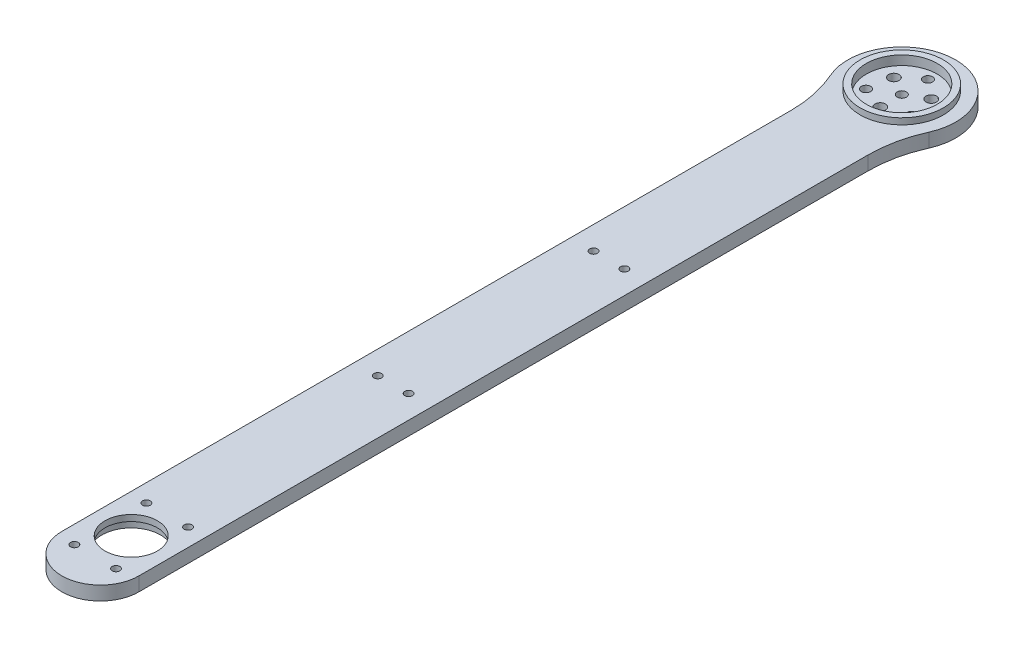
ISO-10303-21;
HEADER;
FILE_DESCRIPTION(('STEP AP214'),'2;1');
FILE_NAME('part.step','',(''),(''),'','','');
FILE_SCHEMA(('AUTOMOTIVE_DESIGN { 1 0 10303 214 1 1 1 1 }'));
ENDSEC;
DATA;
#1=APPLICATION_CONTEXT('core data for automotive mechanical design processes');
#2=APPLICATION_PROTOCOL_DEFINITION('international standard','automotive_design',2000,#1);
#3=PRODUCT_CONTEXT('',#1,'mechanical');
#4=PRODUCT('Part','Part','',(#3));
#5=PRODUCT_RELATED_PRODUCT_CATEGORY('part','',(#4));
#6=PRODUCT_DEFINITION_FORMATION('','',#4);
#7=PRODUCT_DEFINITION_CONTEXT('part definition',#1,'design');
#8=PRODUCT_DEFINITION('design','',#6,#7);
#9=PRODUCT_DEFINITION_SHAPE('','',#8);
#10=(LENGTH_UNIT() NAMED_UNIT(*) SI_UNIT(.MILLI.,.METRE.));
#11=(NAMED_UNIT(*) PLANE_ANGLE_UNIT() SI_UNIT($,.RADIAN.));
#12=(NAMED_UNIT(*) SI_UNIT($,.STERADIAN.) SOLID_ANGLE_UNIT());
#13=UNCERTAINTY_MEASURE_WITH_UNIT(LENGTH_MEASURE(1.E-05),#10,'distance_accuracy_value','');
#14=(GEOMETRIC_REPRESENTATION_CONTEXT(3) GLOBAL_UNCERTAINTY_ASSIGNED_CONTEXT((#13)) GLOBAL_UNIT_ASSIGNED_CONTEXT((#10,
#11,#12)) REPRESENTATION_CONTEXT('',''));
#15=CARTESIAN_POINT('',(0.,0.,0.));
#16=DIRECTION('',(0.,0.,1.));
#17=DIRECTION('',(1.,0.,0.));
#18=AXIS2_PLACEMENT_3D('',#15,#16,#17);
#19=CARTESIAN_POINT('',(-32.4505054253004,4.5,-1111.));
#20=DIRECTION('',(0.,1.,0.));
#21=DIRECTION('',(0.,0.,1.));
#22=AXIS2_PLACEMENT_3D('',#19,#20,#21);
#23=PLANE('',#22);
#24=CARTESIAN_POINT('',(-7.36121593216777,4.5,4.24999999999993));
#25=DIRECTION('',(0.,1.,0.));
#26=DIRECTION('',(0.,0.,1.));
#27=AXIS2_PLACEMENT_3D('',#24,#25,#26);
#28=CIRCLE('',#27,1.49999999999999);
#29=CARTESIAN_POINT('',(-7.36121593216777,4.5,5.74999999999992));
#30=VERTEX_POINT('',#29);
#31=EDGE_CURVE('E47',#30,#30,#28,.T.);
#32=ORIENTED_EDGE('',*,*,#31,.T.);
#33=EDGE_LOOP('',(#32));
#34=FACE_BOUND('',#33,.T.);
#35=CARTESIAN_POINT('',(7.36121593216771,4.5,4.25000000000003));
#36=DIRECTION('',(0.,1.,0.));
#37=DIRECTION('',(0.,0.,1.));
#38=AXIS2_PLACEMENT_3D('',#35,#36,#37);
#39=CIRCLE('',#38,1.49999999999999);
#40=CARTESIAN_POINT('',(7.36121593216771,4.5,5.75000000000002));
#41=VERTEX_POINT('',#40);
#42=EDGE_CURVE('E177',#41,#41,#39,.T.);
#43=ORIENTED_EDGE('',*,*,#42,.T.);
#44=EDGE_LOOP('',(#43));
#45=FACE_BOUND('',#44,.T.);
#46=CARTESIAN_POINT('',(0.,4.5,-8.5));
#47=DIRECTION('',(0.,1.,0.));
#48=DIRECTION('',(0.,0.,1.));
#49=AXIS2_PLACEMENT_3D('',#46,#47,#48);
#50=CIRCLE('',#49,1.49999999999999);
#51=CARTESIAN_POINT('',(0.,4.5,-7.00000000000001));
#52=VERTEX_POINT('',#51);
#53=EDGE_CURVE('E172',#52,#52,#50,.T.);
#54=ORIENTED_EDGE('',*,*,#53,.T.);
#55=EDGE_LOOP('',(#54));
#56=FACE_BOUND('',#55,.T.);
#57=CARTESIAN_POINT('',(0.,4.5,0.));
#58=DIRECTION('',(0.,-1.,0.));
#59=DIRECTION('',(0.,0.,-1.));
#60=AXIS2_PLACEMENT_3D('',#57,#58,#59);
#61=CIRCLE('',#60,1.49999999999999);
#62=CARTESIAN_POINT('',(0.,4.5,-1.49999999999999));
#63=VERTEX_POINT('',#62);
#64=EDGE_CURVE('E175',#63,#63,#61,.T.);
#65=ORIENTED_EDGE('',*,*,#64,.F.);
#66=EDGE_LOOP('',(#65));
#67=FACE_BOUND('',#66,.T.);
#68=CARTESIAN_POINT('',(-6.74999999999998,4.5,238.30865704891));
#69=DIRECTION('',(0.,-1.,0.));
#70=DIRECTION('',(0.,0.,-1.));
#71=AXIS2_PLACEMENT_3D('',#68,#69,#70);
#72=CIRCLE('',#71,1.25);
#73=CARTESIAN_POINT('',(-6.74999999999998,4.5,237.05865704891));
#74=VERTEX_POINT('',#73);
#75=EDGE_CURVE('E203',#74,#74,#72,.T.);
#76=ORIENTED_EDGE('',*,*,#75,.F.);
#77=EDGE_LOOP('',(#76));
#78=FACE_BOUND('',#77,.T.);
#79=CARTESIAN_POINT('',(-6.75,4.5,261.69134295109));
#80=DIRECTION('',(0.,-1.,0.));
#81=DIRECTION('',(0.,0.,-1.));
#82=AXIS2_PLACEMENT_3D('',#79,#80,#81);
#83=CIRCLE('',#82,1.25);
#84=CARTESIAN_POINT('',(-6.75,4.5,260.44134295109));
#85=VERTEX_POINT('',#84);
#86=EDGE_CURVE('E221',#85,#85,#83,.T.);
#87=ORIENTED_EDGE('',*,*,#86,.F.);
#88=EDGE_LOOP('',(#87));
#89=FACE_BOUND('',#88,.T.);
#90=CARTESIAN_POINT('',(-4.99999999999998,4.5,95.));
#91=DIRECTION('',(0.,-1.,0.));
#92=DIRECTION('',(0.,0.,-1.));
#93=AXIS2_PLACEMENT_3D('',#90,#91,#92);
#94=CIRCLE('',#93,1.24999999999999);
#95=CARTESIAN_POINT('',(-4.99999999999998,4.5,93.75));
#96=VERTEX_POINT('',#95);
#97=EDGE_CURVE('E233',#96,#96,#94,.T.);
#98=ORIENTED_EDGE('',*,*,#97,.F.);
#99=EDGE_LOOP('',(#98));
#100=FACE_BOUND('',#99,.T.);
#101=CARTESIAN_POINT('',(-6.06217782649106,4.5,-3.50000000000003));
#102=DIRECTION('',(0.,1.,0.));
#103=DIRECTION('',(0.,0.,1.));
#104=AXIS2_PLACEMENT_3D('',#101,#102,#103);
#105=CIRCLE('',#104,1.7);
#106=CARTESIAN_POINT('',(-6.06217782649106,4.5,-1.80000000000003));
#107=VERTEX_POINT('',#106);
#108=EDGE_CURVE('E265',#107,#107,#105,.F.);
#109=ORIENTED_EDGE('',*,*,#108,.F.);
#110=EDGE_LOOP('',(#109));
#111=FACE_BOUND('',#110,.T.);
#112=CARTESIAN_POINT('',(0.,4.5,250.));
#113=DIRECTION('',(0.,1.,0.));
#114=DIRECTION('',(0.,0.,1.));
#115=AXIS2_PLACEMENT_3D('',#112,#113,#114);
#116=CIRCLE('',#115,9.50000000000001);
#117=CARTESIAN_POINT('',(0.,4.5,259.5));
#118=VERTEX_POINT('',#117);
#119=EDGE_CURVE('E257',#118,#118,#116,.F.);
#120=ORIENTED_EDGE('',*,*,#119,.F.);
#121=EDGE_LOOP('',(#120));
#122=FACE_BOUND('',#121,.T.);
#123=DIRECTION('',(0.,0.,1.));
#124=VECTOR('',#123,1.);
#125=CARTESIAN_POINT('',(-12.5,4.5,260.));
#126=LINE('',#125,#124);
#127=CARTESIAN_POINT('',(-12.5,4.5,23.4520787991171));
#128=VERTEX_POINT('',#127);
#129=CARTESIAN_POINT('',(-12.5,4.5,260.));
#130=VERTEX_POINT('',#129);
#131=EDGE_CURVE('E61',#128,#130,#126,.T.);
#132=ORIENTED_EDGE('',*,*,#131,.F.);
#133=CARTESIAN_POINT('',(-52.5,4.5,23.4520787991171));
#134=DIRECTION('',(0.,1.,0.));
#135=DIRECTION('',(0.,0.,1.));
#136=AXIS2_PLACEMENT_3D('',#133,#134,#135);
#137=CIRCLE('',#136,40.);
#138=CARTESIAN_POINT('',(-15.9782608695652,4.5,7.13758919973129));
#139=VERTEX_POINT('',#138);
#140=EDGE_CURVE('E97',#139,#128,#137,.F.);
#141=ORIENTED_EDGE('',*,*,#140,.F.);
#142=CARTESIAN_POINT('',(0.,4.5,0.));
#143=DIRECTION('',(0.,1.,0.));
#144=DIRECTION('',(0.,0.,1.));
#145=AXIS2_PLACEMENT_3D('',#142,#143,#144);
#146=CIRCLE('',#145,17.5);
#147=CARTESIAN_POINT('',(15.9782608695652,4.5,7.13758919973129));
#148=VERTEX_POINT('',#147);
#149=EDGE_CURVE('E100',#148,#139,#146,.T.);
#150=ORIENTED_EDGE('',*,*,#149,.F.);
#151=CARTESIAN_POINT('',(52.5,4.5,23.4520787991171));
#152=DIRECTION('',(0.,1.,0.));
#153=DIRECTION('',(0.,0.,1.));
#154=AXIS2_PLACEMENT_3D('',#151,#152,#153);
#155=CIRCLE('',#154,40.);
#156=CARTESIAN_POINT('',(12.5,4.5,23.4520787991171));
#157=VERTEX_POINT('',#156);
#158=EDGE_CURVE('E117',#157,#148,#155,.F.);
#159=ORIENTED_EDGE('',*,*,#158,.F.);
#160=DIRECTION('',(0.,0.,-1.));
#161=VECTOR('',#160,1.);
#162=CARTESIAN_POINT('',(12.5,4.5,260.));
#163=LINE('',#162,#161);
#164=CARTESIAN_POINT('',(12.5,4.5,260.));
#165=VERTEX_POINT('',#164);
#166=EDGE_CURVE('E249',#165,#157,#163,.T.);
#167=ORIENTED_EDGE('',*,*,#166,.F.);
#168=CARTESIAN_POINT('',(0.,4.5,260.));
#169=DIRECTION('',(0.,1.,0.));
#170=DIRECTION('',(0.,0.,1.));
#171=AXIS2_PLACEMENT_3D('',#168,#169,#170);
#172=CIRCLE('',#171,12.5);
#173=EDGE_CURVE('E253',#130,#165,#172,.T.);
#174=ORIENTED_EDGE('',*,*,#173,.F.);
#175=EDGE_LOOP('',(#132,#141,#150,#159,#167,#174));
#176=FACE_BOUND('',#175,.T.);
#177=CARTESIAN_POINT('',(6.0621778264911,4.5,-3.49999999999994));
#178=DIRECTION('',(0.,1.,0.));
#179=DIRECTION('',(0.,0.,1.));
#180=AXIS2_PLACEMENT_3D('',#177,#178,#179);
#181=CIRCLE('',#180,1.7);
#182=CARTESIAN_POINT('',(6.0621778264911,4.5,-1.79999999999995));
#183=VERTEX_POINT('',#182);
#184=EDGE_CURVE('E261',#183,#183,#181,.F.);
#185=ORIENTED_EDGE('',*,*,#184,.F.);
#186=EDGE_LOOP('',(#185));
#187=FACE_BOUND('',#186,.T.);
#188=CARTESIAN_POINT('',(0.,4.5,7.));
#189=DIRECTION('',(0.,1.,0.));
#190=DIRECTION('',(0.,0.,1.));
#191=AXIS2_PLACEMENT_3D('',#188,#189,#190);
#192=CIRCLE('',#191,1.7);
#193=CARTESIAN_POINT('',(0.,4.5,8.7));
#194=VERTEX_POINT('',#193);
#195=EDGE_CURVE('E269',#194,#194,#192,.F.);
#196=ORIENTED_EDGE('',*,*,#195,.F.);
#197=EDGE_LOOP('',(#196));
#198=FACE_BOUND('',#197,.T.);
#199=CARTESIAN_POINT('',(-4.99999999999996,4.5,165.));
#200=DIRECTION('',(0.,-1.,0.));
#201=DIRECTION('',(0.,0.,-1.));
#202=AXIS2_PLACEMENT_3D('',#199,#200,#201);
#203=CIRCLE('',#202,1.24999999999999);
#204=CARTESIAN_POINT('',(-4.99999999999996,4.5,163.75));
#205=VERTEX_POINT('',#204);
#206=EDGE_CURVE('E151',#205,#205,#203,.T.);
#207=ORIENTED_EDGE('',*,*,#206,.F.);
#208=EDGE_LOOP('',(#207));
#209=FACE_BOUND('',#208,.T.);
#210=CARTESIAN_POINT('',(5.00000000000002,4.5,95.));
#211=DIRECTION('',(0.,-1.,0.));
#212=DIRECTION('',(0.,0.,-1.));
#213=AXIS2_PLACEMENT_3D('',#210,#211,#212);
#214=CIRCLE('',#213,1.24999999999999);
#215=CARTESIAN_POINT('',(5.00000000000002,4.5,93.75));
#216=VERTEX_POINT('',#215);
#217=EDGE_CURVE('E159',#216,#216,#214,.T.);
#218=ORIENTED_EDGE('',*,*,#217,.F.);
#219=EDGE_LOOP('',(#218));
#220=FACE_BOUND('',#219,.T.);
#221=CARTESIAN_POINT('',(5.00000000000004,4.5,165.));
#222=DIRECTION('',(0.,-1.,0.));
#223=DIRECTION('',(0.,0.,-1.));
#224=AXIS2_PLACEMENT_3D('',#221,#222,#223);
#225=CIRCLE('',#224,1.24999999999999);
#226=CARTESIAN_POINT('',(5.00000000000004,4.5,163.75));
#227=VERTEX_POINT('',#226);
#228=EDGE_CURVE('E11',#227,#227,#225,.T.);
#229=ORIENTED_EDGE('',*,*,#228,.F.);
#230=EDGE_LOOP('',(#229));
#231=FACE_BOUND('',#230,.T.);
#232=CARTESIAN_POINT('',(6.74999999999998,4.5,261.69134295109));
#233=DIRECTION('',(0.,-1.,0.));
#234=DIRECTION('',(0.,0.,-1.));
#235=AXIS2_PLACEMENT_3D('',#232,#233,#234);
#236=CIRCLE('',#235,1.25);
#237=CARTESIAN_POINT('',(6.74999999999998,4.5,260.44134295109));
#238=VERTEX_POINT('',#237);
#239=EDGE_CURVE('E170',#238,#238,#236,.T.);
#240=ORIENTED_EDGE('',*,*,#239,.F.);
#241=EDGE_LOOP('',(#240));
#242=FACE_BOUND('',#241,.T.);
#243=CARTESIAN_POINT('',(6.75000000000006,4.5,238.30865704891));
#244=DIRECTION('',(0.,-1.,0.));
#245=DIRECTION('',(0.,0.,-1.));
#246=AXIS2_PLACEMENT_3D('',#243,#244,#245);
#247=CIRCLE('',#246,1.25);
#248=CARTESIAN_POINT('',(6.75000000000006,4.5,237.05865704891));
#249=VERTEX_POINT('',#248);
#250=EDGE_CURVE('E171',#249,#249,#247,.T.);
#251=ORIENTED_EDGE('',*,*,#250,.F.);
#252=EDGE_LOOP('',(#251));
#253=FACE_BOUND('',#252,.T.);
#254=ADVANCED_FACE('F43',(#34,#45,#56,#67,#78,#89,#100,#111,#122,#176,#187,#198,#209,#220,#231,
#242,#253),#23,.F.);
#255=CARTESIAN_POINT('',(5.00000000000004,4.5,165.));
#256=DIRECTION('',(0.,-1.,0.));
#257=DIRECTION('',(0.,0.,-1.));
#258=AXIS2_PLACEMENT_3D('',#255,#256,#257);
#259=CYLINDRICAL_SURFACE('',#258,1.24999999999998);
#260=CARTESIAN_POINT('',(5.00000000000004,9.,165.));
#261=DIRECTION('',(0.,1.,0.));
#262=DIRECTION('',(0.,0.,1.));
#263=AXIS2_PLACEMENT_3D('',#260,#261,#262);
#264=CIRCLE('',#263,1.24999999999998);
#265=CARTESIAN_POINT('',(5.00000000000004,9.,166.25));
#266=VERTEX_POINT('',#265);
#267=EDGE_CURVE('E53',#266,#266,#264,.T.);
#268=ORIENTED_EDGE('',*,*,#267,.T.);
#269=EDGE_LOOP('',(#268));
#270=FACE_BOUND('',#269,.T.);
#271=ORIENTED_EDGE('',*,*,#228,.T.);
#272=EDGE_LOOP('',(#271));
#273=FACE_BOUND('',#272,.T.);
#274=ADVANCED_FACE('F45',(#270,#273),#259,.F.);
#275=CARTESIAN_POINT('',(5.00000000000002,4.5,95.));
#276=DIRECTION('',(0.,-1.,0.));
#277=DIRECTION('',(0.,0.,-1.));
#278=AXIS2_PLACEMENT_3D('',#275,#276,#277);
#279=CYLINDRICAL_SURFACE('',#278,1.24999999999998);
#280=CARTESIAN_POINT('',(5.00000000000002,9.,95.));
#281=DIRECTION('',(0.,1.,0.));
#282=DIRECTION('',(0.,0.,1.));
#283=AXIS2_PLACEMENT_3D('',#280,#281,#282);
#284=CIRCLE('',#283,1.24999999999998);
#285=CARTESIAN_POINT('',(5.00000000000002,9.,96.25));
#286=VERTEX_POINT('',#285);
#287=EDGE_CURVE('E155',#286,#286,#284,.T.);
#288=ORIENTED_EDGE('',*,*,#287,.T.);
#289=EDGE_LOOP('',(#288));
#290=FACE_BOUND('',#289,.T.);
#291=ORIENTED_EDGE('',*,*,#217,.T.);
#292=EDGE_LOOP('',(#291));
#293=FACE_BOUND('',#292,.T.);
#294=ADVANCED_FACE('F346',(#290,#293),#279,.F.);
#295=CARTESIAN_POINT('',(-4.99999999999996,4.5,165.));
#296=DIRECTION('',(0.,-1.,0.));
#297=DIRECTION('',(0.,0.,-1.));
#298=AXIS2_PLACEMENT_3D('',#295,#296,#297);
#299=CYLINDRICAL_SURFACE('',#298,1.24999999999998);
#300=CARTESIAN_POINT('',(-4.99999999999996,9.,165.));
#301=DIRECTION('',(0.,1.,0.));
#302=DIRECTION('',(0.,0.,1.));
#303=AXIS2_PLACEMENT_3D('',#300,#301,#302);
#304=CIRCLE('',#303,1.24999999999998);
#305=CARTESIAN_POINT('',(-4.99999999999996,9.,166.25));
#306=VERTEX_POINT('',#305);
#307=EDGE_CURVE('E147',#306,#306,#304,.T.);
#308=ORIENTED_EDGE('',*,*,#307,.T.);
#309=EDGE_LOOP('',(#308));
#310=FACE_BOUND('',#309,.T.);
#311=ORIENTED_EDGE('',*,*,#206,.T.);
#312=EDGE_LOOP('',(#311));
#313=FACE_BOUND('',#312,.T.);
#314=ADVANCED_FACE('F371',(#310,#313),#299,.F.);
#315=CARTESIAN_POINT('',(0.,-3.,250.));
#316=DIRECTION('',(0.,1.,0.));
#317=DIRECTION('',(0.,0.,1.));
#318=AXIS2_PLACEMENT_3D('',#315,#316,#317);
#319=CYLINDRICAL_SURFACE('',#318,9.50000000000001);
#320=ORIENTED_EDGE('',*,*,#119,.T.);
#321=EDGE_LOOP('',(#320));
#322=FACE_BOUND('',#321,.T.);
#323=CARTESIAN_POINT('',(0.,7.,250.));
#324=DIRECTION('',(0.,1.,0.));
#325=DIRECTION('',(0.,0.,1.));
#326=AXIS2_PLACEMENT_3D('',#323,#324,#325);
#327=CIRCLE('',#326,9.50000000000001);
#328=CARTESIAN_POINT('',(0.,7.,259.5));
#329=VERTEX_POINT('',#328);
#330=EDGE_CURVE('E107',#329,#329,#327,.F.);
#331=ORIENTED_EDGE('',*,*,#330,.F.);
#332=EDGE_LOOP('',(#331));
#333=FACE_BOUND('',#332,.T.);
#334=ADVANCED_FACE('F367',(#322,#333),#319,.F.);
#335=CARTESIAN_POINT('',(0.,-3.,7.));
#336=DIRECTION('',(0.,-1.,0.));
#337=DIRECTION('',(0.,0.,-1.));
#338=AXIS2_PLACEMENT_3D('',#335,#336,#337);
#339=CYLINDRICAL_SURFACE('',#338,1.7);
#340=ORIENTED_EDGE('',*,*,#195,.T.);
#341=EDGE_LOOP('',(#340));
#342=FACE_BOUND('',#341,.T.);
#343=CARTESIAN_POINT('',(0.,8.,7.));
#344=DIRECTION('',(0.,1.,0.));
#345=DIRECTION('',(0.,0.,1.));
#346=AXIS2_PLACEMENT_3D('',#343,#344,#345);
#347=CIRCLE('',#346,1.7);
#348=CARTESIAN_POINT('',(0.,8.,8.7));
#349=VERTEX_POINT('',#348);
#350=EDGE_CURVE('E285',#349,#349,#347,.F.);
#351=ORIENTED_EDGE('',*,*,#350,.F.);
#352=EDGE_LOOP('',(#351));
#353=FACE_BOUND('',#352,.T.);
#354=ADVANCED_FACE('F363',(#342,#353),#339,.F.);
#355=CARTESIAN_POINT('',(-6.06217782649106,-3.,-3.50000000000003));
#356=DIRECTION('',(0.,-1.,0.));
#357=DIRECTION('',(0.,0.,-1.));
#358=AXIS2_PLACEMENT_3D('',#355,#356,#357);
#359=CYLINDRICAL_SURFACE('',#358,1.7);
#360=ORIENTED_EDGE('',*,*,#108,.T.);
#361=EDGE_LOOP('',(#360));
#362=FACE_BOUND('',#361,.T.);
#363=CARTESIAN_POINT('',(-6.06217782649106,8.,-3.50000000000003));
#364=DIRECTION('',(0.,1.,0.));
#365=DIRECTION('',(0.,0.,1.));
#366=AXIS2_PLACEMENT_3D('',#363,#364,#365);
#367=CIRCLE('',#366,1.7);
#368=CARTESIAN_POINT('',(-6.06217782649106,8.,-1.80000000000003));
#369=VERTEX_POINT('',#368);
#370=EDGE_CURVE('E281',#369,#369,#367,.F.);
#371=ORIENTED_EDGE('',*,*,#370,.F.);
#372=EDGE_LOOP('',(#371));
#373=FACE_BOUND('',#372,.T.);
#374=ADVANCED_FACE('F359',(#362,#373),#359,.F.);
#375=CARTESIAN_POINT('',(6.0621778264911,-3.,-3.49999999999994));
#376=DIRECTION('',(0.,-1.,0.));
#377=DIRECTION('',(0.,0.,-1.));
#378=AXIS2_PLACEMENT_3D('',#375,#376,#377);
#379=CYLINDRICAL_SURFACE('',#378,1.7);
#380=ORIENTED_EDGE('',*,*,#184,.T.);
#381=EDGE_LOOP('',(#380));
#382=FACE_BOUND('',#381,.T.);
#383=CARTESIAN_POINT('',(6.0621778264911,8.,-3.49999999999994));
#384=DIRECTION('',(0.,1.,0.));
#385=DIRECTION('',(0.,0.,1.));
#386=AXIS2_PLACEMENT_3D('',#383,#384,#385);
#387=CIRCLE('',#386,1.7);
#388=CARTESIAN_POINT('',(6.0621778264911,8.,-1.79999999999995));
#389=VERTEX_POINT('',#388);
#390=EDGE_CURVE('E131',#389,#389,#387,.F.);
#391=ORIENTED_EDGE('',*,*,#390,.F.);
#392=EDGE_LOOP('',(#391));
#393=FACE_BOUND('',#392,.T.);
#394=ADVANCED_FACE('F355',(#382,#393),#379,.F.);
#395=CARTESIAN_POINT('',(0.,11.,0.));
#396=DIRECTION('',(0.,1.,0.));
#397=DIRECTION('',(0.,0.,1.));
#398=AXIS2_PLACEMENT_3D('',#395,#396,#397);
#399=PLANE('',#398);
#400=CARTESIAN_POINT('',(0.,11.,0.));
#401=DIRECTION('',(0.,1.,0.));
#402=DIRECTION('',(0.,0.,1.));
#403=AXIS2_PLACEMENT_3D('',#400,#401,#402);
#404=CIRCLE('',#403,11.5);
#405=CARTESIAN_POINT('',(0.,11.,11.5));
#406=VERTEX_POINT('',#405);
#407=EDGE_CURVE('E273',#406,#406,#404,.T.);
#408=ORIENTED_EDGE('',*,*,#407,.F.);
#409=EDGE_LOOP('',(#408));
#410=FACE_BOUND('',#409,.T.);
#411=CARTESIAN_POINT('',(0.,11.,0.));
#412=DIRECTION('',(0.,1.,0.));
#413=DIRECTION('',(0.,0.,1.));
#414=AXIS2_PLACEMENT_3D('',#411,#412,#413);
#415=CIRCLE('',#414,13.5);
#416=CARTESIAN_POINT('',(0.,11.,13.5));
#417=VERTEX_POINT('',#416);
#418=EDGE_CURVE('E289',#417,#417,#415,.T.);
#419=ORIENTED_EDGE('',*,*,#418,.T.);
#420=EDGE_LOOP('',(#419));
#421=FACE_BOUND('',#420,.T.);
#422=ADVANCED_FACE('F358',(#410,#421),#399,.T.);
#423=CARTESIAN_POINT('',(0.,9.,0.));
#424=DIRECTION('',(0.,-1.,0.));
#425=DIRECTION('',(0.,0.,-1.));
#426=AXIS2_PLACEMENT_3D('',#423,#424,#425);
#427=CYLINDRICAL_SURFACE('',#426,17.5);
#428=DIRECTION('',(0.,-1.,0.));
#429=VECTOR('',#428,1.);
#430=CARTESIAN_POINT('',(15.9782608695652,9.,7.1375891997313));
#431=LINE('',#430,#429);
#432=CARTESIAN_POINT('',(15.9782608695652,9.,7.1375891997313));
#433=VERTEX_POINT('',#432);
#434=EDGE_CURVE('E115',#433,#148,#431,.T.);
#435=ORIENTED_EDGE('',*,*,#434,.T.);
#436=ORIENTED_EDGE('',*,*,#149,.T.);
#437=DIRECTION('',(0.,-1.,0.));
#438=VECTOR('',#437,1.);
#439=CARTESIAN_POINT('',(-15.9782608695652,9.,7.1375891997313));
#440=LINE('',#439,#438);
#441=CARTESIAN_POINT('',(-15.9782608695652,9.,7.1375891997313));
#442=VERTEX_POINT('',#441);
#443=EDGE_CURVE('E113',#139,#442,#440,.F.);
#444=ORIENTED_EDGE('',*,*,#443,.T.);
#445=CARTESIAN_POINT('',(0.,9.,0.));
#446=DIRECTION('',(0.,1.,0.));
#447=DIRECTION('',(0.,0.,1.));
#448=AXIS2_PLACEMENT_3D('',#445,#446,#447);
#449=CIRCLE('',#448,17.5);
#450=EDGE_CURVE('E292',#433,#442,#449,.T.);
#451=ORIENTED_EDGE('',*,*,#450,.F.);
#452=EDGE_LOOP('',(#435,#436,#444,#451));
#453=FACE_BOUND('',#452,.T.);
#454=ADVANCED_FACE('F111',(#453),#427,.T.);
#455=CARTESIAN_POINT('',(-12.5,9.,260.));
#456=DIRECTION('',(1.,0.,0.));
#457=DIRECTION('',(0.,0.,-1.));
#458=AXIS2_PLACEMENT_3D('',#455,#456,#457);
#459=PLANE('',#458);
#460=DIRECTION('',(0.,1.,0.));
#461=VECTOR('',#460,1.);
#462=CARTESIAN_POINT('',(-12.5,0.,23.4520787991171));
#463=LINE('',#462,#461);
#464=CARTESIAN_POINT('',(-12.5,9.,23.4520787991171));
#465=VERTEX_POINT('',#464);
#466=EDGE_CURVE('E136',#465,#128,#463,.F.);
#467=ORIENTED_EDGE('',*,*,#466,.T.);
#468=ORIENTED_EDGE('',*,*,#131,.T.);
#469=DIRECTION('',(0.,-1.,0.));
#470=VECTOR('',#469,1.);
#471=CARTESIAN_POINT('',(-12.4999999999999,9.,260.));
#472=LINE('',#471,#470);
#473=CARTESIAN_POINT('',(-12.4999999999999,9.,260.));
#474=VERTEX_POINT('',#473);
#475=EDGE_CURVE('E128',#474,#130,#472,.T.);
#476=ORIENTED_EDGE('',*,*,#475,.F.);
#477=DIRECTION('',(0.,0.,1.));
#478=VECTOR('',#477,1.);
#479=CARTESIAN_POINT('',(-12.5,9.,260.));
#480=LINE('',#479,#478);
#481=EDGE_CURVE('E296',#465,#474,#480,.T.);
#482=ORIENTED_EDGE('',*,*,#481,.F.);
#483=EDGE_LOOP('',(#467,#468,#476,#482));
#484=FACE_BOUND('',#483,.T.);
#485=ADVANCED_FACE('F317',(#484),#459,.F.);
#486=CARTESIAN_POINT('',(0.,9.,260.));
#487=DIRECTION('',(0.,-1.,0.));
#488=DIRECTION('',(0.,0.,-1.));
#489=AXIS2_PLACEMENT_3D('',#486,#487,#488);
#490=CYLINDRICAL_SURFACE('',#489,12.5);
#491=ORIENTED_EDGE('',*,*,#475,.T.);
#492=ORIENTED_EDGE('',*,*,#173,.T.);
#493=DIRECTION('',(0.,-1.,0.));
#494=VECTOR('',#493,1.);
#495=CARTESIAN_POINT('',(12.5,9.,260.));
#496=LINE('',#495,#494);
#497=CARTESIAN_POINT('',(12.5,9.,260.));
#498=VERTEX_POINT('',#497);
#499=EDGE_CURVE('E306',#498,#165,#496,.T.);
#500=ORIENTED_EDGE('',*,*,#499,.F.);
#501=CARTESIAN_POINT('',(0.,9.,260.));
#502=DIRECTION('',(0.,1.,0.));
#503=DIRECTION('',(0.,0.,1.));
#504=AXIS2_PLACEMENT_3D('',#501,#502,#503);
#505=CIRCLE('',#504,12.5);
#506=EDGE_CURVE('E299',#474,#498,#505,.T.);
#507=ORIENTED_EDGE('',*,*,#506,.F.);
#508=EDGE_LOOP('',(#491,#492,#500,#507));
#509=FACE_BOUND('',#508,.T.);
#510=ADVANCED_FACE('F314',(#509),#490,.T.);
#511=CARTESIAN_POINT('',(12.5,9.,260.));
#512=DIRECTION('',(-1.,0.,0.));
#513=DIRECTION('',(0.,0.,1.));
#514=AXIS2_PLACEMENT_3D('',#511,#512,#513);
#515=PLANE('',#514);
#516=ORIENTED_EDGE('',*,*,#499,.T.);
#517=ORIENTED_EDGE('',*,*,#166,.T.);
#518=DIRECTION('',(0.,1.,0.));
#519=VECTOR('',#518,1.);
#520=CARTESIAN_POINT('',(12.5,9.,23.4520787991171));
#521=LINE('',#520,#519);
#522=CARTESIAN_POINT('',(12.5,9.,23.4520787991171));
#523=VERTEX_POINT('',#522);
#524=EDGE_CURVE('E125',#157,#523,#521,.T.);
#525=ORIENTED_EDGE('',*,*,#524,.T.);
#526=DIRECTION('',(0.,0.,-1.));
#527=VECTOR('',#526,1.);
#528=CARTESIAN_POINT('',(12.5,9.,260.));
#529=LINE('',#528,#527);
#530=EDGE_CURVE('E302',#498,#523,#529,.T.);
#531=ORIENTED_EDGE('',*,*,#530,.F.);
#532=EDGE_LOOP('',(#516,#517,#525,#531));
#533=FACE_BOUND('',#532,.T.);
#534=ADVANCED_FACE('F323',(#533),#515,.F.);
#535=CARTESIAN_POINT('',(0.,9.,0.));
#536=DIRECTION('',(0.,1.,0.));
#537=DIRECTION('',(0.,0.,1.));
#538=AXIS2_PLACEMENT_3D('',#535,#536,#537);
#539=PLANE('',#538);
#540=CARTESIAN_POINT('',(-6.74999999999998,9.,238.30865704891));
#541=DIRECTION('',(0.,1.,0.));
#542=DIRECTION('',(0.,0.,1.));
#543=AXIS2_PLACEMENT_3D('',#540,#541,#542);
#544=CIRCLE('',#543,1.25);
#545=CARTESIAN_POINT('',(-6.74999999999998,9.,239.55865704891));
#546=VERTEX_POINT('',#545);
#547=EDGE_CURVE('E207',#546,#546,#544,.T.);
#548=ORIENTED_EDGE('',*,*,#547,.F.);
#549=EDGE_LOOP('',(#548));
#550=FACE_BOUND('',#549,.T.);
#551=CARTESIAN_POINT('',(6.75000000000006,9.,238.30865704891));
#552=DIRECTION('',(0.,1.,0.));
#553=DIRECTION('',(0.,0.,1.));
#554=AXIS2_PLACEMENT_3D('',#551,#552,#553);
#555=CIRCLE('',#554,1.25);
#556=CARTESIAN_POINT('',(6.75000000000006,9.,239.55865704891));
#557=VERTEX_POINT('',#556);
#558=EDGE_CURVE('E166',#557,#557,#555,.T.);
#559=ORIENTED_EDGE('',*,*,#558,.F.);
#560=EDGE_LOOP('',(#559));
#561=FACE_BOUND('',#560,.T.);
#562=CARTESIAN_POINT('',(6.74999999999998,9.,261.69134295109));
#563=DIRECTION('',(0.,1.,0.));
#564=DIRECTION('',(0.,0.,1.));
#565=AXIS2_PLACEMENT_3D('',#562,#563,#564);
#566=CIRCLE('',#565,1.25);
#567=CARTESIAN_POINT('',(6.74999999999998,9.,262.94134295109));
#568=VERTEX_POINT('',#567);
#569=EDGE_CURVE('E217',#568,#568,#566,.T.);
#570=ORIENTED_EDGE('',*,*,#569,.F.);
#571=EDGE_LOOP('',(#570));
#572=FACE_BOUND('',#571,.T.);
#573=CARTESIAN_POINT('',(-6.75,9.,261.69134295109));
#574=DIRECTION('',(0.,1.,0.));
#575=DIRECTION('',(0.,0.,1.));
#576=AXIS2_PLACEMENT_3D('',#573,#574,#575);
#577=CIRCLE('',#576,1.25);
#578=CARTESIAN_POINT('',(-6.75,9.,262.94134295109));
#579=VERTEX_POINT('',#578);
#580=EDGE_CURVE('E225',#579,#579,#577,.T.);
#581=ORIENTED_EDGE('',*,*,#580,.F.);
#582=EDGE_LOOP('',(#581));
#583=FACE_BOUND('',#582,.T.);
#584=CARTESIAN_POINT('',(-4.99999999999998,9.,95.));
#585=DIRECTION('',(0.,1.,0.));
#586=DIRECTION('',(0.,0.,1.));
#587=AXIS2_PLACEMENT_3D('',#584,#585,#586);
#588=CIRCLE('',#587,1.24999999999998);
#589=CARTESIAN_POINT('',(-4.99999999999998,9.,96.25));
#590=VERTEX_POINT('',#589);
#591=EDGE_CURVE('E229',#590,#590,#588,.T.);
#592=ORIENTED_EDGE('',*,*,#591,.F.);
#593=EDGE_LOOP('',(#592));
#594=FACE_BOUND('',#593,.T.);
#595=CARTESIAN_POINT('',(0.,9.,0.));
#596=DIRECTION('',(0.,1.,0.));
#597=DIRECTION('',(0.,0.,1.));
#598=AXIS2_PLACEMENT_3D('',#595,#596,#597);
#599=CIRCLE('',#598,13.5);
#600=CARTESIAN_POINT('',(0.,9.,13.5));
#601=VERTEX_POINT('',#600);
#602=EDGE_CURVE('E121',#601,#601,#599,.T.);
#603=ORIENTED_EDGE('',*,*,#602,.F.);
#604=EDGE_LOOP('',(#603));
#605=FACE_BOUND('',#604,.T.);
#606=ORIENTED_EDGE('',*,*,#530,.T.);
#607=CARTESIAN_POINT('',(52.5,9.,23.4520787991171));
#608=DIRECTION('',(0.,1.,0.));
#609=DIRECTION('',(0.,0.,1.));
#610=AXIS2_PLACEMENT_3D('',#607,#608,#609);
#611=CIRCLE('',#610,40.);
#612=EDGE_CURVE('E139',#523,#433,#611,.F.);
#613=ORIENTED_EDGE('',*,*,#612,.T.);
#614=ORIENTED_EDGE('',*,*,#450,.T.);
#615=CARTESIAN_POINT('',(-52.5,9.,23.4520787991171));
#616=DIRECTION('',(0.,1.,0.));
#617=DIRECTION('',(0.,0.,1.));
#618=AXIS2_PLACEMENT_3D('',#615,#616,#617);
#619=CIRCLE('',#618,40.);
#620=EDGE_CURVE('E69',#442,#465,#619,.F.);
#621=ORIENTED_EDGE('',*,*,#620,.T.);
#622=ORIENTED_EDGE('',*,*,#481,.T.);
#623=ORIENTED_EDGE('',*,*,#506,.T.);
#624=EDGE_LOOP('',(#606,#613,#614,#621,#622,#623));
#625=FACE_BOUND('',#624,.T.);
#626=CARTESIAN_POINT('',(0.,9.,250.));
#627=DIRECTION('',(0.,1.,0.));
#628=DIRECTION('',(0.,0.,1.));
#629=AXIS2_PLACEMENT_3D('',#626,#627,#628);
#630=CIRCLE('',#629,8.5);
#631=CARTESIAN_POINT('',(0.,9.,258.5));
#632=VERTEX_POINT('',#631);
#633=EDGE_CURVE('E237',#632,#632,#630,.T.);
#634=ORIENTED_EDGE('',*,*,#633,.F.);
#635=EDGE_LOOP('',(#634));
#636=FACE_BOUND('',#635,.T.);
#637=ORIENTED_EDGE('',*,*,#307,.F.);
#638=EDGE_LOOP('',(#637));
#639=FACE_BOUND('',#638,.T.);
#640=ORIENTED_EDGE('',*,*,#287,.F.);
#641=EDGE_LOOP('',(#640));
#642=FACE_BOUND('',#641,.T.);
#643=ORIENTED_EDGE('',*,*,#267,.F.);
#644=EDGE_LOOP('',(#643));
#645=FACE_BOUND('',#644,.T.);
#646=ADVANCED_FACE('F318',(#550,#561,#572,#583,#594,#605,#625,#636,#639,#642,#645),#539,.T.);
#647=CARTESIAN_POINT('',(0.,11.,0.));
#648=DIRECTION('',(0.,-1.,0.));
#649=DIRECTION('',(0.,0.,-1.));
#650=AXIS2_PLACEMENT_3D('',#647,#648,#649);
#651=CYLINDRICAL_SURFACE('',#650,13.5);
#652=ORIENTED_EDGE('',*,*,#418,.F.);
#653=EDGE_LOOP('',(#652));
#654=FACE_BOUND('',#653,.T.);
#655=ORIENTED_EDGE('',*,*,#602,.T.);
#656=EDGE_LOOP('',(#655));
#657=FACE_BOUND('',#656,.T.);
#658=ADVANCED_FACE('F352',(#654,#657),#651,.T.);
#659=CARTESIAN_POINT('',(0.,8.,0.));
#660=DIRECTION('',(0.,1.,0.));
#661=DIRECTION('',(0.,0.,1.));
#662=AXIS2_PLACEMENT_3D('',#659,#660,#661);
#663=PLANE('',#662);
#664=CARTESIAN_POINT('',(-7.36121593216777,8.,4.24999999999993));
#665=DIRECTION('',(0.,1.,0.));
#666=DIRECTION('',(0.,0.,1.));
#667=AXIS2_PLACEMENT_3D('',#664,#665,#666);
#668=CIRCLE('',#667,1.49999999999999);
#669=CARTESIAN_POINT('',(-7.36121593216777,8.,5.74999999999992));
#670=VERTEX_POINT('',#669);
#671=EDGE_CURVE('E193',#670,#670,#668,.T.);
#672=ORIENTED_EDGE('',*,*,#671,.F.);
#673=EDGE_LOOP('',(#672));
#674=FACE_BOUND('',#673,.T.);
#675=CARTESIAN_POINT('',(7.36121593216771,8.,4.25000000000003));
#676=DIRECTION('',(0.,1.,0.));
#677=DIRECTION('',(0.,0.,1.));
#678=AXIS2_PLACEMENT_3D('',#675,#676,#677);
#679=CIRCLE('',#678,1.49999999999999);
#680=CARTESIAN_POINT('',(7.36121593216771,8.,5.75000000000002));
#681=VERTEX_POINT('',#680);
#682=EDGE_CURVE('E180',#681,#681,#679,.T.);
#683=ORIENTED_EDGE('',*,*,#682,.F.);
#684=EDGE_LOOP('',(#683));
#685=FACE_BOUND('',#684,.T.);
#686=CARTESIAN_POINT('',(0.,8.,-8.5));
#687=DIRECTION('',(0.,1.,0.));
#688=DIRECTION('',(0.,0.,1.));
#689=AXIS2_PLACEMENT_3D('',#686,#687,#688);
#690=CIRCLE('',#689,1.49999999999999);
#691=CARTESIAN_POINT('',(0.,8.,-7.00000000000001));
#692=VERTEX_POINT('',#691);
#693=EDGE_CURVE('E176',#692,#692,#690,.T.);
#694=ORIENTED_EDGE('',*,*,#693,.F.);
#695=EDGE_LOOP('',(#694));
#696=FACE_BOUND('',#695,.T.);
#697=CARTESIAN_POINT('',(0.,8.,0.));
#698=DIRECTION('',(0.,1.,0.));
#699=DIRECTION('',(0.,0.,1.));
#700=AXIS2_PLACEMENT_3D('',#697,#698,#699);
#701=CIRCLE('',#700,1.49999999999999);
#702=CARTESIAN_POINT('',(0.,8.,1.49999999999999));
#703=VERTEX_POINT('',#702);
#704=EDGE_CURVE('E199',#703,#703,#701,.T.);
#705=ORIENTED_EDGE('',*,*,#704,.F.);
#706=EDGE_LOOP('',(#705));
#707=FACE_BOUND('',#706,.T.);
#708=CARTESIAN_POINT('',(0.,8.,0.));
#709=DIRECTION('',(0.,1.,0.));
#710=DIRECTION('',(0.,0.,1.));
#711=AXIS2_PLACEMENT_3D('',#708,#709,#710);
#712=CIRCLE('',#711,11.5);
#713=CARTESIAN_POINT('',(0.,8.,11.5));
#714=VERTEX_POINT('',#713);
#715=EDGE_CURVE('E274',#714,#714,#712,.T.);
#716=ORIENTED_EDGE('',*,*,#715,.T.);
#717=EDGE_LOOP('',(#716));
#718=FACE_BOUND('',#717,.T.);
#719=ORIENTED_EDGE('',*,*,#390,.T.);
#720=EDGE_LOOP('',(#719));
#721=FACE_BOUND('',#720,.T.);
#722=ORIENTED_EDGE('',*,*,#370,.T.);
#723=EDGE_LOOP('',(#722));
#724=FACE_BOUND('',#723,.T.);
#725=ORIENTED_EDGE('',*,*,#350,.T.);
#726=EDGE_LOOP('',(#725));
#727=FACE_BOUND('',#726,.T.);
#728=ADVANCED_FACE('F336',(#674,#685,#696,#707,#718,#721,#724,#727),#663,.T.);
#729=CARTESIAN_POINT('',(0.,8.,0.));
#730=DIRECTION('',(0.,1.,0.));
#731=DIRECTION('',(0.,0.,1.));
#732=AXIS2_PLACEMENT_3D('',#729,#730,#731);
#733=CYLINDRICAL_SURFACE('',#732,11.5);
#734=ORIENTED_EDGE('',*,*,#715,.F.);
#735=EDGE_LOOP('',(#734));
#736=FACE_BOUND('',#735,.T.);
#737=ORIENTED_EDGE('',*,*,#407,.T.);
#738=EDGE_LOOP('',(#737));
#739=FACE_BOUND('',#738,.T.);
#740=ADVANCED_FACE('F328',(#736,#739),#733,.F.);
#741=CARTESIAN_POINT('',(52.5,9.,23.4520787991171));
#742=DIRECTION('',(0.,-1.,0.));
#743=DIRECTION('',(0.,0.,-1.));
#744=AXIS2_PLACEMENT_3D('',#741,#742,#743);
#745=CYLINDRICAL_SURFACE('',#744,40.);
#746=ORIENTED_EDGE('',*,*,#524,.F.);
#747=ORIENTED_EDGE('',*,*,#158,.T.);
#748=ORIENTED_EDGE('',*,*,#434,.F.);
#749=ORIENTED_EDGE('',*,*,#612,.F.);
#750=EDGE_LOOP('',(#746,#747,#748,#749));
#751=FACE_BOUND('',#750,.T.);
#752=ADVANCED_FACE('F326',(#751),#745,.F.);
#753=CARTESIAN_POINT('',(-52.5,9.,23.4520787991171));
#754=DIRECTION('',(0.,-1.,0.));
#755=DIRECTION('',(0.,0.,-1.));
#756=AXIS2_PLACEMENT_3D('',#753,#754,#755);
#757=CYLINDRICAL_SURFACE('',#756,40.);
#758=ORIENTED_EDGE('',*,*,#443,.F.);
#759=ORIENTED_EDGE('',*,*,#140,.T.);
#760=ORIENTED_EDGE('',*,*,#466,.F.);
#761=ORIENTED_EDGE('',*,*,#620,.F.);
#762=EDGE_LOOP('',(#758,#759,#760,#761));
#763=FACE_BOUND('',#762,.T.);
#764=ADVANCED_FACE('F119',(#763),#757,.F.);
#765=CARTESIAN_POINT('',(0.,7.,250.));
#766=DIRECTION('',(0.,1.,0.));
#767=DIRECTION('',(0.,0.,1.));
#768=AXIS2_PLACEMENT_3D('',#765,#766,#767);
#769=PLANE('',#768);
#770=CARTESIAN_POINT('',(0.,7.,250.));
#771=DIRECTION('',(0.,1.,0.));
#772=DIRECTION('',(0.,0.,1.));
#773=AXIS2_PLACEMENT_3D('',#770,#771,#772);
#774=CIRCLE('',#773,8.5);
#775=CARTESIAN_POINT('',(0.,7.,258.5));
#776=VERTEX_POINT('',#775);
#777=EDGE_CURVE('E238',#776,#776,#774,.T.);
#778=ORIENTED_EDGE('',*,*,#777,.T.);
#779=EDGE_LOOP('',(#778));
#780=FACE_BOUND('',#779,.T.);
#781=ORIENTED_EDGE('',*,*,#330,.T.);
#782=EDGE_LOOP('',(#781));
#783=FACE_BOUND('',#782,.T.);
#784=ADVANCED_FACE('F334',(#780,#783),#769,.F.);
#785=CARTESIAN_POINT('',(0.,7.,250.));
#786=DIRECTION('',(0.,1.,0.));
#787=DIRECTION('',(0.,0.,1.));
#788=AXIS2_PLACEMENT_3D('',#785,#786,#787);
#789=CYLINDRICAL_SURFACE('',#788,8.5);
#790=ORIENTED_EDGE('',*,*,#777,.F.);
#791=EDGE_LOOP('',(#790));
#792=FACE_BOUND('',#791,.T.);
#793=ORIENTED_EDGE('',*,*,#633,.T.);
#794=EDGE_LOOP('',(#793));
#795=FACE_BOUND('',#794,.T.);
#796=ADVANCED_FACE('F481',(#792,#795),#789,.F.);
#797=CARTESIAN_POINT('',(-4.99999999999998,4.5,95.));
#798=DIRECTION('',(0.,-1.,0.));
#799=DIRECTION('',(0.,0.,-1.));
#800=AXIS2_PLACEMENT_3D('',#797,#798,#799);
#801=CYLINDRICAL_SURFACE('',#800,1.24999999999998);
#802=ORIENTED_EDGE('',*,*,#591,.T.);
#803=EDGE_LOOP('',(#802));
#804=FACE_BOUND('',#803,.T.);
#805=ORIENTED_EDGE('',*,*,#97,.T.);
#806=EDGE_LOOP('',(#805));
#807=FACE_BOUND('',#806,.T.);
#808=ADVANCED_FACE('F489',(#804,#807),#801,.F.);
#809=CARTESIAN_POINT('',(-6.75,4.5,261.69134295109));
#810=DIRECTION('',(0.,-1.,0.));
#811=DIRECTION('',(0.,0.,-1.));
#812=AXIS2_PLACEMENT_3D('',#809,#810,#811);
#813=CYLINDRICAL_SURFACE('',#812,1.25);
#814=ORIENTED_EDGE('',*,*,#580,.T.);
#815=EDGE_LOOP('',(#814));
#816=FACE_BOUND('',#815,.T.);
#817=ORIENTED_EDGE('',*,*,#86,.T.);
#818=EDGE_LOOP('',(#817));
#819=FACE_BOUND('',#818,.T.);
#820=ADVANCED_FACE('F517',(#816,#819),#813,.F.);
#821=CARTESIAN_POINT('',(6.74999999999998,4.5,261.69134295109));
#822=DIRECTION('',(0.,-1.,0.));
#823=DIRECTION('',(0.,0.,-1.));
#824=AXIS2_PLACEMENT_3D('',#821,#822,#823);
#825=CYLINDRICAL_SURFACE('',#824,1.25);
#826=ORIENTED_EDGE('',*,*,#569,.T.);
#827=EDGE_LOOP('',(#826));
#828=FACE_BOUND('',#827,.T.);
#829=ORIENTED_EDGE('',*,*,#239,.T.);
#830=EDGE_LOOP('',(#829));
#831=FACE_BOUND('',#830,.T.);
#832=ADVANCED_FACE('F526',(#828,#831),#825,.F.);
#833=CARTESIAN_POINT('',(6.75000000000006,4.5,238.30865704891));
#834=DIRECTION('',(0.,-1.,0.));
#835=DIRECTION('',(0.,0.,-1.));
#836=AXIS2_PLACEMENT_3D('',#833,#834,#835);
#837=CYLINDRICAL_SURFACE('',#836,1.25);
#838=ORIENTED_EDGE('',*,*,#558,.T.);
#839=EDGE_LOOP('',(#838));
#840=FACE_BOUND('',#839,.T.);
#841=ORIENTED_EDGE('',*,*,#250,.T.);
#842=EDGE_LOOP('',(#841));
#843=FACE_BOUND('',#842,.T.);
#844=ADVANCED_FACE('F542',(#840,#843),#837,.F.);
#845=CARTESIAN_POINT('',(-6.74999999999998,4.5,238.30865704891));
#846=DIRECTION('',(0.,-1.,0.));
#847=DIRECTION('',(0.,0.,-1.));
#848=AXIS2_PLACEMENT_3D('',#845,#846,#847);
#849=CYLINDRICAL_SURFACE('',#848,1.25);
#850=ORIENTED_EDGE('',*,*,#547,.T.);
#851=EDGE_LOOP('',(#850));
#852=FACE_BOUND('',#851,.T.);
#853=ORIENTED_EDGE('',*,*,#75,.T.);
#854=EDGE_LOOP('',(#853));
#855=FACE_BOUND('',#854,.T.);
#856=ADVANCED_FACE('F550',(#852,#855),#849,.F.);
#857=CARTESIAN_POINT('',(0.,4.5,0.));
#858=DIRECTION('',(0.,-1.,0.));
#859=DIRECTION('',(0.,0.,-1.));
#860=AXIS2_PLACEMENT_3D('',#857,#858,#859);
#861=CYLINDRICAL_SURFACE('',#860,1.49999999999999);
#862=ORIENTED_EDGE('',*,*,#704,.T.);
#863=EDGE_LOOP('',(#862));
#864=FACE_BOUND('',#863,.T.);
#865=ORIENTED_EDGE('',*,*,#64,.T.);
#866=EDGE_LOOP('',(#865));
#867=FACE_BOUND('',#866,.T.);
#868=ADVANCED_FACE('F557',(#864,#867),#861,.F.);
#869=CARTESIAN_POINT('',(0.,8.,-8.5));
#870=DIRECTION('',(0.,1.,0.));
#871=DIRECTION('',(0.,0.,1.));
#872=AXIS2_PLACEMENT_3D('',#869,#870,#871);
#873=CYLINDRICAL_SURFACE('',#872,1.49999999999999);
#874=ORIENTED_EDGE('',*,*,#693,.T.);
#875=EDGE_LOOP('',(#874));
#876=FACE_BOUND('',#875,.T.);
#877=ORIENTED_EDGE('',*,*,#53,.F.);
#878=EDGE_LOOP('',(#877));
#879=FACE_BOUND('',#878,.T.);
#880=ADVANCED_FACE('F566',(#876,#879),#873,.F.);
#881=CARTESIAN_POINT('',(7.36121593216771,8.,4.25000000000003));
#882=DIRECTION('',(0.,1.,0.));
#883=DIRECTION('',(0.,0.,1.));
#884=AXIS2_PLACEMENT_3D('',#881,#882,#883);
#885=CYLINDRICAL_SURFACE('',#884,1.49999999999999);
#886=ORIENTED_EDGE('',*,*,#682,.T.);
#887=EDGE_LOOP('',(#886));
#888=FACE_BOUND('',#887,.T.);
#889=ORIENTED_EDGE('',*,*,#42,.F.);
#890=EDGE_LOOP('',(#889));
#891=FACE_BOUND('',#890,.T.);
#892=ADVANCED_FACE('F574',(#888,#891),#885,.F.);
#893=CARTESIAN_POINT('',(-7.36121593216777,8.,4.24999999999993));
#894=DIRECTION('',(0.,1.,0.));
#895=DIRECTION('',(0.,0.,1.));
#896=AXIS2_PLACEMENT_3D('',#893,#894,#895);
#897=CYLINDRICAL_SURFACE('',#896,1.49999999999999);
#898=ORIENTED_EDGE('',*,*,#671,.T.);
#899=EDGE_LOOP('',(#898));
#900=FACE_BOUND('',#899,.T.);
#901=ORIENTED_EDGE('',*,*,#31,.F.);
#902=EDGE_LOOP('',(#901));
#903=FACE_BOUND('',#902,.T.);
#904=ADVANCED_FACE('F581',(#900,#903),#897,.F.);
#905=CLOSED_SHELL('',(#254,#274,#294,#314,#334,#354,#374,#394,#422,#454,#485,#510,#534,#646,
#658,#728,#740,#752,#764,#784,#796,#808,#820,#832,#844,#856,#868,#880,#892,#904));
#906=MANIFOLD_SOLID_BREP('B2',#905);
#907=ADVANCED_BREP_SHAPE_REPRESENTATION('',(#18,#906),#14);
#908=SHAPE_DEFINITION_REPRESENTATION(#9,#907);
ENDSEC;
END-ISO-10303-21;
